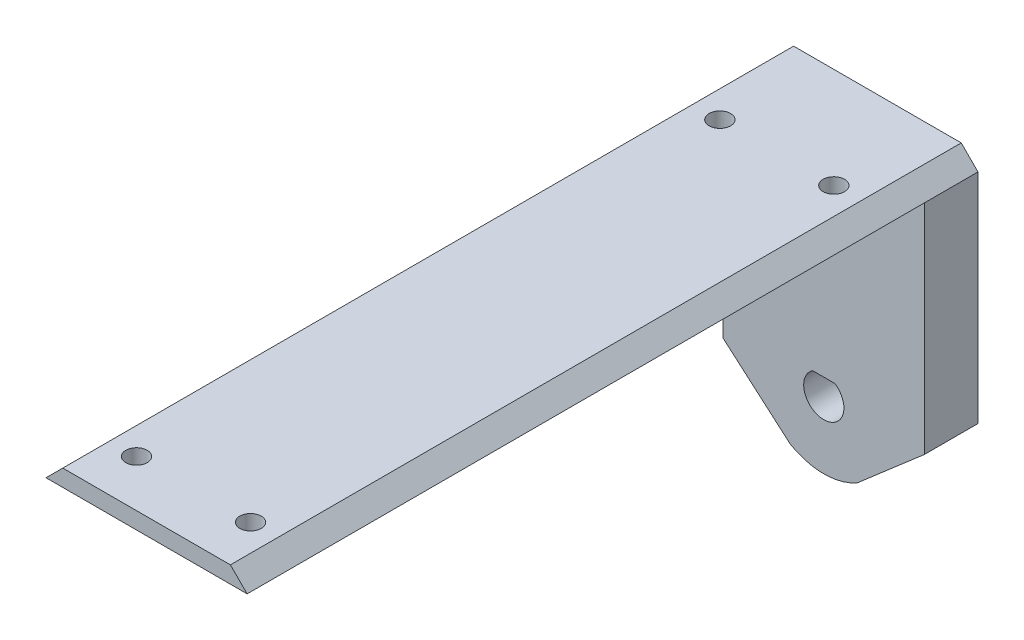
ISO-10303-21;
HEADER;
FILE_DESCRIPTION(('STEP AP214'),'2;1');
FILE_NAME('part.step','',(''),(''),'','','');
FILE_SCHEMA(('AUTOMOTIVE_DESIGN { 1 0 10303 214 1 1 1 1 }'));
ENDSEC;
DATA;
#1=APPLICATION_CONTEXT('core data for automotive mechanical design processes');
#2=APPLICATION_PROTOCOL_DEFINITION('international standard','automotive_design',2000,#1);
#3=PRODUCT_CONTEXT('',#1,'mechanical');
#4=PRODUCT('Part','Part','',(#3));
#5=PRODUCT_RELATED_PRODUCT_CATEGORY('part','',(#4));
#6=PRODUCT_DEFINITION_FORMATION('','',#4);
#7=PRODUCT_DEFINITION_CONTEXT('part definition',#1,'design');
#8=PRODUCT_DEFINITION('design','',#6,#7);
#9=PRODUCT_DEFINITION_SHAPE('','',#8);
#10=(LENGTH_UNIT() NAMED_UNIT(*) SI_UNIT(.MILLI.,.METRE.));
#11=(NAMED_UNIT(*) PLANE_ANGLE_UNIT() SI_UNIT($,.RADIAN.));
#12=(NAMED_UNIT(*) SI_UNIT($,.STERADIAN.) SOLID_ANGLE_UNIT());
#13=UNCERTAINTY_MEASURE_WITH_UNIT(LENGTH_MEASURE(1.E-05),#10,'distance_accuracy_value','');
#14=(GEOMETRIC_REPRESENTATION_CONTEXT(3) GLOBAL_UNCERTAINTY_ASSIGNED_CONTEXT((#13)) GLOBAL_UNIT_ASSIGNED_CONTEXT((#10,
#11,#12)) REPRESENTATION_CONTEXT('',''));
#15=CARTESIAN_POINT('',(0.,0.,0.));
#16=DIRECTION('',(0.,0.,1.));
#17=DIRECTION('',(1.,0.,0.));
#18=AXIS2_PLACEMENT_3D('',#15,#16,#17);
#19=CARTESIAN_POINT('',(0.,-7.,8.));
#20=DIRECTION('',(0.,0.,-1.));
#21=DIRECTION('',(-1.,0.,0.));
#22=AXIS2_PLACEMENT_3D('',#19,#20,#21);
#23=CYLINDRICAL_SURFACE('',#22,3.);
#24=CARTESIAN_POINT('',(0.,-7.,0.));
#25=DIRECTION('',(0.,0.,1.));
#26=DIRECTION('',(1.,0.,0.));
#27=AXIS2_PLACEMENT_3D('',#24,#25,#26);
#28=CIRCLE('',#27,3.);
#29=CARTESIAN_POINT('',(-1.6583123951777,-4.5,0.));
#30=VERTEX_POINT('',#29);
#31=CARTESIAN_POINT('',(1.6583123951777,-4.5,0.));
#32=VERTEX_POINT('',#31);
#33=EDGE_CURVE('E146',#30,#32,#28,.T.);
#34=ORIENTED_EDGE('',*,*,#33,.F.);
#35=DIRECTION('',(0.,0.,-1.));
#36=VECTOR('',#35,1.);
#37=CARTESIAN_POINT('',(-1.6583123951777,-4.5,8.));
#38=LINE('',#37,#36);
#39=CARTESIAN_POINT('',(-1.6583123951777,-4.5,8.));
#40=VERTEX_POINT('',#39);
#41=EDGE_CURVE('E11',#40,#30,#38,.T.);
#42=ORIENTED_EDGE('',*,*,#41,.F.);
#43=CARTESIAN_POINT('',(0.,-7.,8.));
#44=DIRECTION('',(0.,0.,1.));
#45=DIRECTION('',(1.,0.,0.));
#46=AXIS2_PLACEMENT_3D('',#43,#44,#45);
#47=CIRCLE('',#46,3.);
#48=CARTESIAN_POINT('',(1.6583123951777,-4.5,8.));
#49=VERTEX_POINT('',#48);
#50=EDGE_CURVE('E123',#40,#49,#47,.T.);
#51=ORIENTED_EDGE('',*,*,#50,.T.);
#52=DIRECTION('',(0.,0.,-1.));
#53=VECTOR('',#52,1.);
#54=CARTESIAN_POINT('',(1.6583123951777,-4.5,8.));
#55=LINE('',#54,#53);
#56=EDGE_CURVE('E46',#49,#32,#55,.T.);
#57=ORIENTED_EDGE('',*,*,#56,.T.);
#58=EDGE_LOOP('',(#34,#42,#51,#57));
#59=FACE_BOUND('',#58,.T.);
#60=ADVANCED_FACE('F36',(#59),#23,.F.);
#61=CARTESIAN_POINT('',(0.,-7.,8.));
#62=DIRECTION('',(0.,0.,-1.));
#63=DIRECTION('',(-1.,0.,0.));
#64=AXIS2_PLACEMENT_3D('',#61,#62,#63);
#65=CYLINDRICAL_SURFACE('',#64,10.);
#66=CARTESIAN_POINT('',(0.,-7.,0.));
#67=DIRECTION('',(0.,0.,1.));
#68=DIRECTION('',(1.,0.,0.));
#69=AXIS2_PLACEMENT_3D('',#66,#67,#68);
#70=CIRCLE('',#69,10.);
#71=CARTESIAN_POINT('',(5.,-15.6602540378444,0.));
#72=VERTEX_POINT('',#71);
#73=CARTESIAN_POINT('',(-5.,-15.6602540378444,0.));
#74=VERTEX_POINT('',#73);
#75=EDGE_CURVE('E133',#72,#74,#70,.F.);
#76=ORIENTED_EDGE('',*,*,#75,.F.);
#77=DIRECTION('',(0.,0.,-1.));
#78=VECTOR('',#77,1.);
#79=CARTESIAN_POINT('',(5.,-15.6602540378444,8.));
#80=LINE('',#79,#78);
#81=CARTESIAN_POINT('',(5.,-15.6602540378444,8.));
#82=VERTEX_POINT('',#81);
#83=EDGE_CURVE('E84',#82,#72,#80,.T.);
#84=ORIENTED_EDGE('',*,*,#83,.F.);
#85=CARTESIAN_POINT('',(0.,-7.,8.));
#86=DIRECTION('',(0.,0.,1.));
#87=DIRECTION('',(1.,0.,0.));
#88=AXIS2_PLACEMENT_3D('',#85,#86,#87);
#89=CIRCLE('',#88,10.);
#90=CARTESIAN_POINT('',(-5.,-15.6602540378444,8.));
#91=VERTEX_POINT('',#90);
#92=EDGE_CURVE('E110',#82,#91,#89,.F.);
#93=ORIENTED_EDGE('',*,*,#92,.T.);
#94=DIRECTION('',(0.,0.,-1.));
#95=VECTOR('',#94,1.);
#96=CARTESIAN_POINT('',(-5.,-15.6602540378444,8.));
#97=LINE('',#96,#95);
#98=EDGE_CURVE('E100',#91,#74,#97,.T.);
#99=ORIENTED_EDGE('',*,*,#98,.T.);
#100=EDGE_LOOP('',(#76,#84,#93,#99));
#101=FACE_BOUND('',#100,.T.);
#102=ADVANCED_FACE('F38',(#101),#65,.T.);
#103=CARTESIAN_POINT('',(9.89267304370918,-11.4230748895809,8.));
#104=DIRECTION('',(0.654653670707977,-0.755928946018455,0.));
#105=DIRECTION('',(0.755928946018455,0.654653670707977,0.));
#106=AXIS2_PLACEMENT_3D('',#103,#104,#105);
#107=PLANE('',#106);
#108=DIRECTION('',(-0.755928946018455,-0.654653670707977,0.));
#109=VECTOR('',#108,1.);
#110=CARTESIAN_POINT('',(9.89267304370918,-11.4230748895809,0.));
#111=LINE('',#110,#109);
#112=CARTESIAN_POINT('',(15.,-7.,0.));
#113=VERTEX_POINT('',#112);
#114=EDGE_CURVE('E135',#113,#72,#111,.T.);
#115=ORIENTED_EDGE('',*,*,#114,.F.);
#116=DIRECTION('',(0.,0.,-1.));
#117=VECTOR('',#116,1.);
#118=CARTESIAN_POINT('',(15.,-7.,8.));
#119=LINE('',#118,#117);
#120=CARTESIAN_POINT('',(15.,-7.,8.));
#121=VERTEX_POINT('',#120);
#122=EDGE_CURVE('E153',#121,#113,#119,.T.);
#123=ORIENTED_EDGE('',*,*,#122,.F.);
#124=DIRECTION('',(-0.755928946018455,-0.654653670707977,0.));
#125=VECTOR('',#124,1.);
#126=CARTESIAN_POINT('',(9.89267304370918,-11.4230748895809,8.));
#127=LINE('',#126,#125);
#128=EDGE_CURVE('E114',#121,#82,#127,.T.);
#129=ORIENTED_EDGE('',*,*,#128,.T.);
#130=ORIENTED_EDGE('',*,*,#83,.T.);
#131=EDGE_LOOP('',(#115,#123,#129,#130));
#132=FACE_BOUND('',#131,.T.);
#133=ADVANCED_FACE('F232',(#132),#107,.T.);
#134=CARTESIAN_POINT('',(15.,0.,8.));
#135=DIRECTION('',(-1.,0.,0.));
#136=DIRECTION('',(0.,0.,1.));
#137=AXIS2_PLACEMENT_3D('',#134,#135,#136);
#138=PLANE('',#137);
#139=DIRECTION('',(0.,1.,0.));
#140=VECTOR('',#139,1.);
#141=CARTESIAN_POINT('',(15.,0.,0.));
#142=LINE('',#141,#140);
#143=CARTESIAN_POINT('',(15.,25.5,0.));
#144=VERTEX_POINT('',#143);
#145=EDGE_CURVE('E139',#113,#144,#142,.T.);
#146=ORIENTED_EDGE('',*,*,#145,.T.);
#147=DIRECTION('',(0.,0.,-1.));
#148=VECTOR('',#147,1.);
#149=CARTESIAN_POINT('',(15.,25.5,8.));
#150=LINE('',#149,#148);
#151=CARTESIAN_POINT('',(15.,25.5,7.99999999999999));
#152=VERTEX_POINT('',#151);
#153=EDGE_CURVE('E155',#152,#144,#150,.T.);
#154=ORIENTED_EDGE('',*,*,#153,.F.);
#155=DIRECTION('',(0.,1.,0.));
#156=VECTOR('',#155,1.);
#157=CARTESIAN_POINT('',(15.,0.,8.));
#158=LINE('',#157,#156);
#159=EDGE_CURVE('E158',#121,#152,#158,.T.);
#160=ORIENTED_EDGE('',*,*,#159,.F.);
#161=ORIENTED_EDGE('',*,*,#122,.T.);
#162=EDGE_LOOP('',(#146,#154,#160,#161));
#163=FACE_BOUND('',#162,.T.);
#164=ADVANCED_FACE('F238',(#163),#138,.F.);
#165=CARTESIAN_POINT('',(-15.,0.,8.));
#166=DIRECTION('',(-1.,0.,0.));
#167=DIRECTION('',(0.,0.,1.));
#168=AXIS2_PLACEMENT_3D('',#165,#166,#167);
#169=PLANE('',#168);
#170=DIRECTION('',(0.,1.,0.));
#171=VECTOR('',#170,1.);
#172=CARTESIAN_POINT('',(-15.,0.,0.));
#173=LINE('',#172,#171);
#174=CARTESIAN_POINT('',(-15.,-7.,0.));
#175=VERTEX_POINT('',#174);
#176=CARTESIAN_POINT('',(-15.,25.5,0.));
#177=VERTEX_POINT('',#176);
#178=EDGE_CURVE('E142',#175,#177,#173,.T.);
#179=ORIENTED_EDGE('',*,*,#178,.F.);
#180=DIRECTION('',(0.,0.,-1.));
#181=VECTOR('',#180,1.);
#182=CARTESIAN_POINT('',(-15.,-7.,8.));
#183=LINE('',#182,#181);
#184=CARTESIAN_POINT('',(-15.,-7.,8.));
#185=VERTEX_POINT('',#184);
#186=EDGE_CURVE('E107',#185,#175,#183,.T.);
#187=ORIENTED_EDGE('',*,*,#186,.F.);
#188=DIRECTION('',(0.,1.,0.));
#189=VECTOR('',#188,1.);
#190=CARTESIAN_POINT('',(-15.,0.,8.));
#191=LINE('',#190,#189);
#192=CARTESIAN_POINT('',(-15.,25.5,8.));
#193=VERTEX_POINT('',#192);
#194=EDGE_CURVE('E122',#185,#193,#191,.T.);
#195=ORIENTED_EDGE('',*,*,#194,.T.);
#196=DIRECTION('',(0.,0.,-1.));
#197=VECTOR('',#196,1.);
#198=CARTESIAN_POINT('',(-15.,25.5,8.));
#199=LINE('',#198,#197);
#200=EDGE_CURVE('E152',#193,#177,#199,.T.);
#201=ORIENTED_EDGE('',*,*,#200,.T.);
#202=EDGE_LOOP('',(#179,#187,#195,#201));
#203=FACE_BOUND('',#202,.T.);
#204=ADVANCED_FACE('F304',(#203),#169,.T.);
#205=CARTESIAN_POINT('',(-9.89267304370918,-11.4230748895809,8.));
#206=DIRECTION('',(-0.654653670707977,-0.755928946018455,0.));
#207=DIRECTION('',(0.755928946018455,-0.654653670707977,0.));
#208=AXIS2_PLACEMENT_3D('',#205,#206,#207);
#209=PLANE('',#208);
#210=DIRECTION('',(-0.755928946018455,0.654653670707977,0.));
#211=VECTOR('',#210,1.);
#212=CARTESIAN_POINT('',(-9.89267304370918,-11.4230748895809,0.));
#213=LINE('',#212,#211);
#214=EDGE_CURVE('E105',#74,#175,#213,.T.);
#215=ORIENTED_EDGE('',*,*,#214,.F.);
#216=ORIENTED_EDGE('',*,*,#98,.F.);
#217=DIRECTION('',(-0.755928946018455,0.654653670707977,0.));
#218=VECTOR('',#217,1.);
#219=CARTESIAN_POINT('',(-9.89267304370918,-11.4230748895809,8.));
#220=LINE('',#219,#218);
#221=EDGE_CURVE('E103',#91,#185,#220,.T.);
#222=ORIENTED_EDGE('',*,*,#221,.T.);
#223=ORIENTED_EDGE('',*,*,#186,.T.);
#224=EDGE_LOOP('',(#215,#216,#222,#223));
#225=FACE_BOUND('',#224,.T.);
#226=ADVANCED_FACE('F101',(#225),#209,.T.);
#227=CARTESIAN_POINT('',(0.,-4.5,8.));
#228=DIRECTION('',(0.,-1.,0.));
#229=DIRECTION('',(0.,0.,-1.));
#230=AXIS2_PLACEMENT_3D('',#227,#228,#229);
#231=PLANE('',#230);
#232=DIRECTION('',(-1.,0.,0.));
#233=VECTOR('',#232,1.);
#234=CARTESIAN_POINT('',(0.,-4.5,0.));
#235=LINE('',#234,#233);
#236=EDGE_CURVE('E115',#32,#30,#235,.T.);
#237=ORIENTED_EDGE('',*,*,#236,.F.);
#238=ORIENTED_EDGE('',*,*,#56,.F.);
#239=DIRECTION('',(-1.,0.,0.));
#240=VECTOR('',#239,1.);
#241=CARTESIAN_POINT('',(0.,-4.5,8.));
#242=LINE('',#241,#240);
#243=EDGE_CURVE('E108',#49,#40,#242,.T.);
#244=ORIENTED_EDGE('',*,*,#243,.T.);
#245=ORIENTED_EDGE('',*,*,#41,.T.);
#246=EDGE_LOOP('',(#237,#238,#244,#245));
#247=FACE_BOUND('',#246,.T.);
#248=ADVANCED_FACE('F301',(#247),#231,.T.);
#249=CARTESIAN_POINT('',(0.,0.,8.));
#250=DIRECTION('',(0.,0.,1.));
#251=DIRECTION('',(1.,0.,0.));
#252=AXIS2_PLACEMENT_3D('',#249,#250,#251);
#253=PLANE('',#252);
#254=ORIENTED_EDGE('',*,*,#92,.F.);
#255=ORIENTED_EDGE('',*,*,#128,.F.);
#256=ORIENTED_EDGE('',*,*,#159,.T.);
#257=DIRECTION('',(-1.,0.,0.));
#258=VECTOR('',#257,1.);
#259=CARTESIAN_POINT('',(0.,25.5,8.));
#260=LINE('',#259,#258);
#261=EDGE_CURVE('E126',#152,#193,#260,.T.);
#262=ORIENTED_EDGE('',*,*,#261,.T.);
#263=ORIENTED_EDGE('',*,*,#194,.F.);
#264=ORIENTED_EDGE('',*,*,#221,.F.);
#265=EDGE_LOOP('',(#254,#255,#256,#262,#263,#264));
#266=FACE_BOUND('',#265,.T.);
#267=ORIENTED_EDGE('',*,*,#50,.F.);
#268=ORIENTED_EDGE('',*,*,#243,.F.);
#269=EDGE_LOOP('',(#267,#268));
#270=FACE_BOUND('',#269,.T.);
#271=ADVANCED_FACE('F118',(#266,#270),#253,.T.);
#272=CARTESIAN_POINT('',(0.,0.,0.));
#273=DIRECTION('',(0.,0.,1.));
#274=DIRECTION('',(1.,0.,0.));
#275=AXIS2_PLACEMENT_3D('',#272,#273,#274);
#276=PLANE('',#275);
#277=ORIENTED_EDGE('',*,*,#75,.T.);
#278=ORIENTED_EDGE('',*,*,#214,.T.);
#279=ORIENTED_EDGE('',*,*,#178,.T.);
#280=DIRECTION('',(0.707106781186546,0.707106781186549,0.));
#281=VECTOR('',#280,1.);
#282=CARTESIAN_POINT('',(-20.25,20.2499999999999,0.));
#283=LINE('',#282,#281);
#284=CARTESIAN_POINT('',(-12.5,28.,0.));
#285=VERTEX_POINT('',#284);
#286=EDGE_CURVE('E214',#177,#285,#283,.T.);
#287=ORIENTED_EDGE('',*,*,#286,.T.);
#288=DIRECTION('',(1.,0.,0.));
#289=VECTOR('',#288,1.);
#290=CARTESIAN_POINT('',(0.,28.,0.));
#291=LINE('',#290,#289);
#292=CARTESIAN_POINT('',(12.5,28.,0.));
#293=VERTEX_POINT('',#292);
#294=EDGE_CURVE('E197',#285,#293,#291,.T.);
#295=ORIENTED_EDGE('',*,*,#294,.T.);
#296=DIRECTION('',(-0.707106781186551,0.707106781186544,0.));
#297=VECTOR('',#296,1.);
#298=CARTESIAN_POINT('',(20.2499999999999,20.2500000000001,0.));
#299=LINE('',#298,#297);
#300=EDGE_CURVE('E202',#144,#293,#299,.T.);
#301=ORIENTED_EDGE('',*,*,#300,.F.);
#302=ORIENTED_EDGE('',*,*,#145,.F.);
#303=ORIENTED_EDGE('',*,*,#114,.T.);
#304=EDGE_LOOP('',(#277,#278,#279,#287,#295,#301,#302,#303));
#305=FACE_BOUND('',#304,.T.);
#306=ORIENTED_EDGE('',*,*,#33,.T.);
#307=ORIENTED_EDGE('',*,*,#236,.T.);
#308=EDGE_LOOP('',(#306,#307));
#309=FACE_BOUND('',#308,.T.);
#310=ADVANCED_FACE('F251',(#305,#309),#276,.F.);
#311=CARTESIAN_POINT('',(0.,25.5,109.));
#312=DIRECTION('',(0.,-1.,0.));
#313=DIRECTION('',(0.,0.,-1.));
#314=AXIS2_PLACEMENT_3D('',#311,#312,#313);
#315=PLANE('',#314);
#316=CARTESIAN_POINT('',(-8.50000000000001,25.5,15.));
#317=DIRECTION('',(0.,-1.,0.));
#318=DIRECTION('',(0.,0.,-1.));
#319=AXIS2_PLACEMENT_3D('',#316,#317,#318);
#320=CIRCLE('',#319,1.59999999999999);
#321=CARTESIAN_POINT('',(-8.50000000000001,25.5,13.4));
#322=VERTEX_POINT('',#321);
#323=EDGE_CURVE('E40',#322,#322,#320,.T.);
#324=ORIENTED_EDGE('',*,*,#323,.F.);
#325=EDGE_LOOP('',(#324));
#326=FACE_BOUND('',#325,.T.);
#327=CARTESIAN_POINT('',(8.49999999999997,25.5,15.));
#328=DIRECTION('',(0.,-1.,0.));
#329=DIRECTION('',(0.,0.,-1.));
#330=AXIS2_PLACEMENT_3D('',#327,#328,#329);
#331=CIRCLE('',#330,1.59999999999999);
#332=CARTESIAN_POINT('',(8.49999999999997,25.5,13.4));
#333=VERTEX_POINT('',#332);
#334=EDGE_CURVE('E177',#333,#333,#331,.T.);
#335=ORIENTED_EDGE('',*,*,#334,.F.);
#336=EDGE_LOOP('',(#335));
#337=FACE_BOUND('',#336,.T.);
#338=CARTESIAN_POINT('',(-8.5,25.5,102.));
#339=DIRECTION('',(0.,-1.,0.));
#340=DIRECTION('',(0.,0.,-1.));
#341=AXIS2_PLACEMENT_3D('',#338,#339,#340);
#342=CIRCLE('',#341,1.59999999999999);
#343=CARTESIAN_POINT('',(-8.5,25.5,100.4));
#344=VERTEX_POINT('',#343);
#345=EDGE_CURVE('E173',#344,#344,#342,.T.);
#346=ORIENTED_EDGE('',*,*,#345,.F.);
#347=EDGE_LOOP('',(#346));
#348=FACE_BOUND('',#347,.T.);
#349=CARTESIAN_POINT('',(8.49999999999998,25.5,102.));
#350=DIRECTION('',(0.,-1.,0.));
#351=DIRECTION('',(0.,0.,-1.));
#352=AXIS2_PLACEMENT_3D('',#349,#350,#351);
#353=CIRCLE('',#352,1.59999999999999);
#354=CARTESIAN_POINT('',(8.49999999999998,25.5,100.4));
#355=VERTEX_POINT('',#354);
#356=EDGE_CURVE('E194',#355,#355,#353,.T.);
#357=ORIENTED_EDGE('',*,*,#356,.F.);
#358=EDGE_LOOP('',(#357));
#359=FACE_BOUND('',#358,.T.);
#360=ORIENTED_EDGE('',*,*,#261,.F.);
#361=DIRECTION('',(0.,0.,-1.));
#362=VECTOR('',#361,1.);
#363=CARTESIAN_POINT('',(15.,25.5,109.));
#364=LINE('',#363,#362);
#365=CARTESIAN_POINT('',(15.,25.5,109.));
#366=VERTEX_POINT('',#365);
#367=EDGE_CURVE('E221',#366,#152,#364,.T.);
#368=ORIENTED_EDGE('',*,*,#367,.F.);
#369=DIRECTION('',(-1.,0.,0.));
#370=VECTOR('',#369,1.);
#371=CARTESIAN_POINT('',(0.,25.5,109.));
#372=LINE('',#371,#370);
#373=CARTESIAN_POINT('',(-15.,25.5,109.));
#374=VERTEX_POINT('',#373);
#375=EDGE_CURVE('E205',#366,#374,#372,.T.);
#376=ORIENTED_EDGE('',*,*,#375,.T.);
#377=DIRECTION('',(0.,0.,-1.));
#378=VECTOR('',#377,1.);
#379=CARTESIAN_POINT('',(-15.,25.5,109.));
#380=LINE('',#379,#378);
#381=EDGE_CURVE('E229',#374,#193,#380,.T.);
#382=ORIENTED_EDGE('',*,*,#381,.T.);
#383=EDGE_LOOP('',(#360,#368,#376,#382));
#384=FACE_BOUND('',#383,.T.);
#385=ADVANCED_FACE('F279',(#326,#337,#348,#359,#384),#315,.T.);
#386=CARTESIAN_POINT('',(0.,28.,109.));
#387=DIRECTION('',(0.,1.,0.));
#388=DIRECTION('',(-1.,0.,0.));
#389=AXIS2_PLACEMENT_3D('',#386,#387,#388);
#390=PLANE('',#389);
#391=CARTESIAN_POINT('',(-8.50000000000001,28.,15.));
#392=DIRECTION('',(0.,1.,0.));
#393=DIRECTION('',(0.,0.,1.));
#394=AXIS2_PLACEMENT_3D('',#391,#392,#393);
#395=CIRCLE('',#394,1.59999999999999);
#396=CARTESIAN_POINT('',(-8.50000000000001,28.,16.6));
#397=VERTEX_POINT('',#396);
#398=EDGE_CURVE('E189',#397,#397,#395,.T.);
#399=ORIENTED_EDGE('',*,*,#398,.F.);
#400=EDGE_LOOP('',(#399));
#401=FACE_BOUND('',#400,.T.);
#402=CARTESIAN_POINT('',(8.49999999999997,28.,15.));
#403=DIRECTION('',(0.,1.,0.));
#404=DIRECTION('',(0.,0.,1.));
#405=AXIS2_PLACEMENT_3D('',#402,#403,#404);
#406=CIRCLE('',#405,1.59999999999999);
#407=CARTESIAN_POINT('',(8.49999999999997,28.,16.6));
#408=VERTEX_POINT('',#407);
#409=EDGE_CURVE('E179',#408,#408,#406,.T.);
#410=ORIENTED_EDGE('',*,*,#409,.F.);
#411=EDGE_LOOP('',(#410));
#412=FACE_BOUND('',#411,.T.);
#413=CARTESIAN_POINT('',(-8.5,28.,102.));
#414=DIRECTION('',(0.,1.,0.));
#415=DIRECTION('',(0.,0.,1.));
#416=AXIS2_PLACEMENT_3D('',#413,#414,#415);
#417=CIRCLE('',#416,1.59999999999999);
#418=CARTESIAN_POINT('',(-8.5,28.,103.6));
#419=VERTEX_POINT('',#418);
#420=EDGE_CURVE('E176',#419,#419,#417,.T.);
#421=ORIENTED_EDGE('',*,*,#420,.F.);
#422=EDGE_LOOP('',(#421));
#423=FACE_BOUND('',#422,.T.);
#424=CARTESIAN_POINT('',(8.49999999999998,28.,102.));
#425=DIRECTION('',(0.,1.,0.));
#426=DIRECTION('',(0.,0.,1.));
#427=AXIS2_PLACEMENT_3D('',#424,#425,#426);
#428=CIRCLE('',#427,1.59999999999999);
#429=CARTESIAN_POINT('',(8.49999999999998,28.,103.6));
#430=VERTEX_POINT('',#429);
#431=EDGE_CURVE('E175',#430,#430,#428,.T.);
#432=ORIENTED_EDGE('',*,*,#431,.F.);
#433=EDGE_LOOP('',(#432));
#434=FACE_BOUND('',#433,.T.);
#435=ORIENTED_EDGE('',*,*,#294,.F.);
#436=DIRECTION('',(0.,0.,-1.));
#437=VECTOR('',#436,1.);
#438=CARTESIAN_POINT('',(-12.5,28.,109.));
#439=LINE('',#438,#437);
#440=CARTESIAN_POINT('',(-12.5,28.,109.));
#441=VERTEX_POINT('',#440);
#442=EDGE_CURVE('E136',#441,#285,#439,.T.);
#443=ORIENTED_EDGE('',*,*,#442,.F.);
#444=DIRECTION('',(1.,0.,0.));
#445=VECTOR('',#444,1.);
#446=CARTESIAN_POINT('',(0.,28.,109.));
#447=LINE('',#446,#445);
#448=CARTESIAN_POINT('',(12.5,28.,109.));
#449=VERTEX_POINT('',#448);
#450=EDGE_CURVE('E198',#441,#449,#447,.T.);
#451=ORIENTED_EDGE('',*,*,#450,.T.);
#452=DIRECTION('',(0.,0.,-1.));
#453=VECTOR('',#452,1.);
#454=CARTESIAN_POINT('',(12.5,28.,109.));
#455=LINE('',#454,#453);
#456=EDGE_CURVE('E211',#449,#293,#455,.T.);
#457=ORIENTED_EDGE('',*,*,#456,.T.);
#458=EDGE_LOOP('',(#435,#443,#451,#457));
#459=FACE_BOUND('',#458,.T.);
#460=ADVANCED_FACE('F259',(#401,#412,#423,#434,#459),#390,.T.);
#461=CARTESIAN_POINT('',(-20.25,20.2499999999999,109.));
#462=DIRECTION('',(-0.707106781186549,0.707106781186546,0.));
#463=DIRECTION('',(-0.707106781186546,-0.707106781186549,0.));
#464=AXIS2_PLACEMENT_3D('',#461,#462,#463);
#465=PLANE('',#464);
#466=ORIENTED_EDGE('',*,*,#286,.F.);
#467=ORIENTED_EDGE('',*,*,#200,.F.);
#468=ORIENTED_EDGE('',*,*,#381,.F.);
#469=DIRECTION('',(0.707106781186546,0.707106781186549,0.));
#470=VECTOR('',#469,1.);
#471=CARTESIAN_POINT('',(-20.25,20.2499999999999,109.));
#472=LINE('',#471,#470);
#473=EDGE_CURVE('E201',#374,#441,#472,.T.);
#474=ORIENTED_EDGE('',*,*,#473,.T.);
#475=ORIENTED_EDGE('',*,*,#442,.T.);
#476=EDGE_LOOP('',(#466,#467,#468,#474,#475));
#477=FACE_BOUND('',#476,.T.);
#478=ADVANCED_FACE('F274',(#477),#465,.T.);
#479=CARTESIAN_POINT('',(20.2499999999999,20.2500000000001,109.));
#480=DIRECTION('',(-0.707106781186544,-0.707106781186551,0.));
#481=DIRECTION('',(0.707106781186551,-0.707106781186544,0.));
#482=AXIS2_PLACEMENT_3D('',#479,#480,#481);
#483=PLANE('',#482);
#484=ORIENTED_EDGE('',*,*,#300,.T.);
#485=ORIENTED_EDGE('',*,*,#456,.F.);
#486=DIRECTION('',(-0.707106781186551,0.707106781186544,0.));
#487=VECTOR('',#486,1.);
#488=CARTESIAN_POINT('',(20.2499999999999,20.2500000000001,109.));
#489=LINE('',#488,#487);
#490=EDGE_CURVE('E208',#366,#449,#489,.T.);
#491=ORIENTED_EDGE('',*,*,#490,.F.);
#492=ORIENTED_EDGE('',*,*,#367,.T.);
#493=ORIENTED_EDGE('',*,*,#153,.T.);
#494=EDGE_LOOP('',(#484,#485,#491,#492,#493));
#495=FACE_BOUND('',#494,.T.);
#496=ADVANCED_FACE('F243',(#495),#483,.F.);
#497=CARTESIAN_POINT('',(0.,0.,109.));
#498=DIRECTION('',(0.,0.,1.));
#499=DIRECTION('',(1.,0.,0.));
#500=AXIS2_PLACEMENT_3D('',#497,#498,#499);
#501=PLANE('',#500);
#502=ORIENTED_EDGE('',*,*,#450,.F.);
#503=ORIENTED_EDGE('',*,*,#473,.F.);
#504=ORIENTED_EDGE('',*,*,#375,.F.);
#505=ORIENTED_EDGE('',*,*,#490,.T.);
#506=EDGE_LOOP('',(#502,#503,#504,#505));
#507=FACE_BOUND('',#506,.T.);
#508=ADVANCED_FACE('F278',(#507),#501,.T.);
#509=CARTESIAN_POINT('',(8.49999999999998,28.,102.));
#510=DIRECTION('',(0.,1.,0.));
#511=DIRECTION('',(0.,0.,1.));
#512=AXIS2_PLACEMENT_3D('',#509,#510,#511);
#513=CYLINDRICAL_SURFACE('',#512,1.59999999999999);
#514=ORIENTED_EDGE('',*,*,#356,.T.);
#515=EDGE_LOOP('',(#514));
#516=FACE_BOUND('',#515,.T.);
#517=ORIENTED_EDGE('',*,*,#431,.T.);
#518=EDGE_LOOP('',(#517));
#519=FACE_BOUND('',#518,.T.);
#520=ADVANCED_FACE('F366',(#516,#519),#513,.F.);
#521=CARTESIAN_POINT('',(-8.5,28.,102.));
#522=DIRECTION('',(0.,1.,0.));
#523=DIRECTION('',(0.,0.,1.));
#524=AXIS2_PLACEMENT_3D('',#521,#522,#523);
#525=CYLINDRICAL_SURFACE('',#524,1.59999999999999);
#526=ORIENTED_EDGE('',*,*,#345,.T.);
#527=EDGE_LOOP('',(#526));
#528=FACE_BOUND('',#527,.T.);
#529=ORIENTED_EDGE('',*,*,#420,.T.);
#530=EDGE_LOOP('',(#529));
#531=FACE_BOUND('',#530,.T.);
#532=ADVANCED_FACE('F384',(#528,#531),#525,.F.);
#533=CARTESIAN_POINT('',(8.49999999999997,28.,15.));
#534=DIRECTION('',(0.,1.,0.));
#535=DIRECTION('',(0.,0.,1.));
#536=AXIS2_PLACEMENT_3D('',#533,#534,#535);
#537=CYLINDRICAL_SURFACE('',#536,1.59999999999999);
#538=ORIENTED_EDGE('',*,*,#334,.T.);
#539=EDGE_LOOP('',(#538));
#540=FACE_BOUND('',#539,.T.);
#541=ORIENTED_EDGE('',*,*,#409,.T.);
#542=EDGE_LOOP('',(#541));
#543=FACE_BOUND('',#542,.T.);
#544=ADVANCED_FACE('F394',(#540,#543),#537,.F.);
#545=CARTESIAN_POINT('',(-8.50000000000001,28.,15.));
#546=DIRECTION('',(0.,1.,0.));
#547=DIRECTION('',(0.,0.,1.));
#548=AXIS2_PLACEMENT_3D('',#545,#546,#547);
#549=CYLINDRICAL_SURFACE('',#548,1.59999999999999);
#550=ORIENTED_EDGE('',*,*,#323,.T.);
#551=EDGE_LOOP('',(#550));
#552=FACE_BOUND('',#551,.T.);
#553=ORIENTED_EDGE('',*,*,#398,.T.);
#554=EDGE_LOOP('',(#553));
#555=FACE_BOUND('',#554,.T.);
#556=ADVANCED_FACE('F404',(#552,#555),#549,.F.);
#557=CLOSED_SHELL('',(#60,#102,#133,#164,#204,#226,#248,#271,#310,#385,#460,#478,#496,#508,#520,
#532,#544,#556));
#558=MANIFOLD_SOLID_BREP('B2',#557);
#559=ADVANCED_BREP_SHAPE_REPRESENTATION('',(#18,#558),#14);
#560=SHAPE_DEFINITION_REPRESENTATION(#9,#559);
ENDSEC;
END-ISO-10303-21;
